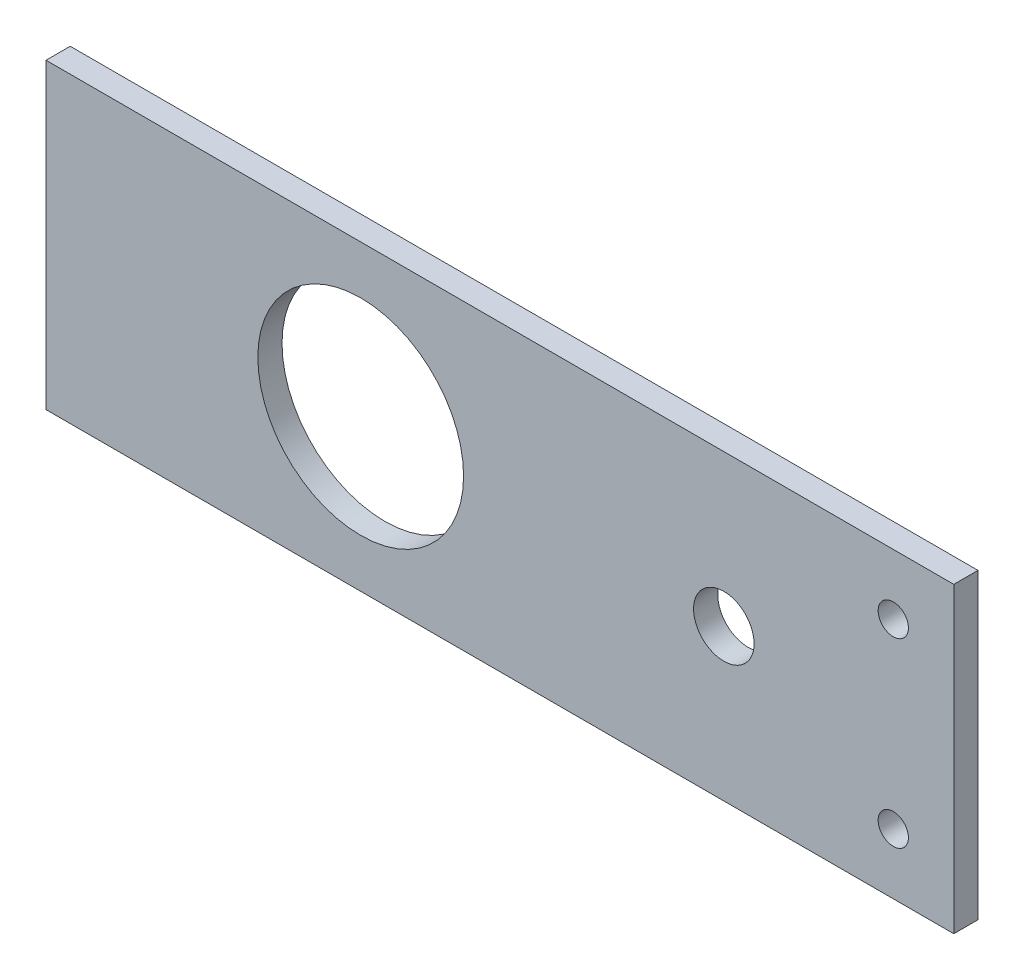
ISO-10303-21;
HEADER;
FILE_DESCRIPTION(('STEP AP214'),'2;1');
FILE_NAME('part.step','',(''),(''),'','','');
FILE_SCHEMA(('AUTOMOTIVE_DESIGN { 1 0 10303 214 1 1 1 1 }'));
ENDSEC;
DATA;
#1=APPLICATION_CONTEXT('core data for automotive mechanical design processes');
#2=APPLICATION_PROTOCOL_DEFINITION('international standard','automotive_design',2000,#1);
#3=PRODUCT_CONTEXT('',#1,'mechanical');
#4=PRODUCT('Part','Part','',(#3));
#5=PRODUCT_RELATED_PRODUCT_CATEGORY('part','',(#4));
#6=PRODUCT_DEFINITION_FORMATION('','',#4);
#7=PRODUCT_DEFINITION_CONTEXT('part definition',#1,'design');
#8=PRODUCT_DEFINITION('design','',#6,#7);
#9=PRODUCT_DEFINITION_SHAPE('','',#8);
#10=(LENGTH_UNIT() NAMED_UNIT(*) SI_UNIT(.MILLI.,.METRE.));
#11=(NAMED_UNIT(*) PLANE_ANGLE_UNIT() SI_UNIT($,.RADIAN.));
#12=(NAMED_UNIT(*) SI_UNIT($,.STERADIAN.) SOLID_ANGLE_UNIT());
#13=UNCERTAINTY_MEASURE_WITH_UNIT(LENGTH_MEASURE(1.E-05),#10,'distance_accuracy_value','');
#14=(GEOMETRIC_REPRESENTATION_CONTEXT(3) GLOBAL_UNCERTAINTY_ASSIGNED_CONTEXT((#13)) GLOBAL_UNIT_ASSIGNED_CONTEXT((#10,
#11,#12)) REPRESENTATION_CONTEXT('',''));
#15=CARTESIAN_POINT('',(0.,0.,0.));
#16=DIRECTION('',(0.,0.,1.));
#17=DIRECTION('',(1.,0.,0.));
#18=AXIS2_PLACEMENT_3D('',#15,#16,#17);
#19=CARTESIAN_POINT('',(0.,0.,4.));
#20=DIRECTION('',(0.,0.,1.));
#21=DIRECTION('',(1.,0.,0.));
#22=AXIS2_PLACEMENT_3D('',#19,#20,#21);
#23=PLANE('',#22);
#24=CARTESIAN_POINT('',(65.,15.,4.));
#25=DIRECTION('',(0.,0.,1.));
#26=DIRECTION('',(1.,0.,0.));
#27=AXIS2_PLACEMENT_3D('',#24,#25,#26);
#28=CIRCLE('',#27,2.5);
#29=CARTESIAN_POINT('',(67.5,15.,4.));
#30=VERTEX_POINT('',#29);
#31=EDGE_CURVE('E127',#30,#30,#28,.T.);
#32=ORIENTED_EDGE('',*,*,#31,.F.);
#33=EDGE_LOOP('',(#32));
#34=FACE_BOUND('',#33,.T.);
#35=CARTESIAN_POINT('',(65.,-15.,4.));
#36=DIRECTION('',(0.,0.,1.));
#37=DIRECTION('',(1.,0.,0.));
#38=AXIS2_PLACEMENT_3D('',#35,#36,#37);
#39=CIRCLE('',#38,2.5);
#40=CARTESIAN_POINT('',(67.5,-15.,4.));
#41=VERTEX_POINT('',#40);
#42=EDGE_CURVE('E135',#41,#41,#39,.T.);
#43=ORIENTED_EDGE('',*,*,#42,.F.);
#44=EDGE_LOOP('',(#43));
#45=FACE_BOUND('',#44,.T.);
#46=CARTESIAN_POINT('',(37.,0.,4.));
#47=DIRECTION('',(0.,0.,1.));
#48=DIRECTION('',(1.,0.,0.));
#49=AXIS2_PLACEMENT_3D('',#46,#47,#48);
#50=CIRCLE('',#49,4.99999999999998);
#51=CARTESIAN_POINT('',(42.,0.,4.));
#52=VERTEX_POINT('',#51);
#53=EDGE_CURVE('E114',#52,#52,#50,.T.);
#54=ORIENTED_EDGE('',*,*,#53,.F.);
#55=EDGE_LOOP('',(#54));
#56=FACE_BOUND('',#55,.T.);
#57=DIRECTION('',(0.,-1.,0.));
#58=VECTOR('',#57,1.);
#59=CARTESIAN_POINT('',(-75.,-25.,4.));
#60=LINE('',#59,#58);
#61=CARTESIAN_POINT('',(-75.,25.,4.));
#62=VERTEX_POINT('',#61);
#63=CARTESIAN_POINT('',(-75.,-25.,4.));
#64=VERTEX_POINT('',#63);
#65=EDGE_CURVE('E93',#62,#64,#60,.T.);
#66=ORIENTED_EDGE('',*,*,#65,.T.);
#67=DIRECTION('',(1.,0.,0.));
#68=VECTOR('',#67,1.);
#69=CARTESIAN_POINT('',(75.,-25.,4.));
#70=LINE('',#69,#68);
#71=CARTESIAN_POINT('',(75.,-25.,4.));
#72=VERTEX_POINT('',#71);
#73=EDGE_CURVE('E88',#64,#72,#70,.T.);
#74=ORIENTED_EDGE('',*,*,#73,.T.);
#75=DIRECTION('',(0.,1.,0.));
#76=VECTOR('',#75,1.);
#77=CARTESIAN_POINT('',(75.,-25.,4.));
#78=LINE('',#77,#76);
#79=CARTESIAN_POINT('',(75.,25.,4.));
#80=VERTEX_POINT('',#79);
#81=EDGE_CURVE('E91',#72,#80,#78,.T.);
#82=ORIENTED_EDGE('',*,*,#81,.T.);
#83=DIRECTION('',(-1.,0.,0.));
#84=VECTOR('',#83,1.);
#85=CARTESIAN_POINT('',(75.,25.,4.));
#86=LINE('',#85,#84);
#87=EDGE_CURVE('E58',#80,#62,#86,.T.);
#88=ORIENTED_EDGE('',*,*,#87,.T.);
#89=EDGE_LOOP('',(#66,#74,#82,#88));
#90=FACE_BOUND('',#89,.T.);
#91=CARTESIAN_POINT('',(-23.,0.,4.));
#92=DIRECTION('',(0.,0.,1.));
#93=DIRECTION('',(1.,0.,0.));
#94=AXIS2_PLACEMENT_3D('',#91,#92,#93);
#95=CIRCLE('',#94,17.);
#96=CARTESIAN_POINT('',(-6.,0.,4.));
#97=VERTEX_POINT('',#96);
#98=EDGE_CURVE('E143',#97,#97,#95,.T.);
#99=ORIENTED_EDGE('',*,*,#98,.F.);
#100=EDGE_LOOP('',(#99));
#101=FACE_BOUND('',#100,.T.);
#102=ADVANCED_FACE('F38',(#34,#45,#56,#90,#101),#23,.T.);
#103=CARTESIAN_POINT('',(0.,0.,0.));
#104=DIRECTION('',(0.,0.,1.));
#105=DIRECTION('',(1.,0.,0.));
#106=AXIS2_PLACEMENT_3D('',#103,#104,#105);
#107=PLANE('',#106);
#108=CARTESIAN_POINT('',(65.,15.,0.));
#109=DIRECTION('',(0.,0.,1.));
#110=DIRECTION('',(1.,0.,0.));
#111=AXIS2_PLACEMENT_3D('',#108,#109,#110);
#112=CIRCLE('',#111,2.5);
#113=CARTESIAN_POINT('',(67.5,15.,0.));
#114=VERTEX_POINT('',#113);
#115=EDGE_CURVE('E42',#114,#114,#112,.T.);
#116=ORIENTED_EDGE('',*,*,#115,.T.);
#117=EDGE_LOOP('',(#116));
#118=FACE_BOUND('',#117,.T.);
#119=CARTESIAN_POINT('',(65.,-15.,0.));
#120=DIRECTION('',(0.,0.,1.));
#121=DIRECTION('',(1.,0.,0.));
#122=AXIS2_PLACEMENT_3D('',#119,#120,#121);
#123=CIRCLE('',#122,2.5);
#124=CARTESIAN_POINT('',(67.5,-15.,0.));
#125=VERTEX_POINT('',#124);
#126=EDGE_CURVE('E124',#125,#125,#123,.T.);
#127=ORIENTED_EDGE('',*,*,#126,.T.);
#128=EDGE_LOOP('',(#127));
#129=FACE_BOUND('',#128,.T.);
#130=DIRECTION('',(0.,-1.,0.));
#131=VECTOR('',#130,1.);
#132=CARTESIAN_POINT('',(-75.,-25.,0.));
#133=LINE('',#132,#131);
#134=CARTESIAN_POINT('',(-75.,25.,0.));
#135=VERTEX_POINT('',#134);
#136=CARTESIAN_POINT('',(-75.,-25.,0.));
#137=VERTEX_POINT('',#136);
#138=EDGE_CURVE('E110',#135,#137,#133,.T.);
#139=ORIENTED_EDGE('',*,*,#138,.F.);
#140=DIRECTION('',(-1.,0.,0.));
#141=VECTOR('',#140,1.);
#142=CARTESIAN_POINT('',(75.,25.,0.));
#143=LINE('',#142,#141);
#144=CARTESIAN_POINT('',(75.,25.,0.));
#145=VERTEX_POINT('',#144);
#146=EDGE_CURVE('E81',#145,#135,#143,.T.);
#147=ORIENTED_EDGE('',*,*,#146,.F.);
#148=DIRECTION('',(0.,1.,0.));
#149=VECTOR('',#148,1.);
#150=CARTESIAN_POINT('',(75.,-25.,0.));
#151=LINE('',#150,#149);
#152=CARTESIAN_POINT('',(75.,-25.,0.));
#153=VERTEX_POINT('',#152);
#154=EDGE_CURVE('E75',#153,#145,#151,.T.);
#155=ORIENTED_EDGE('',*,*,#154,.F.);
#156=DIRECTION('',(1.,0.,0.));
#157=VECTOR('',#156,1.);
#158=CARTESIAN_POINT('',(75.,-25.,0.));
#159=LINE('',#158,#157);
#160=EDGE_CURVE('E98',#137,#153,#159,.T.);
#161=ORIENTED_EDGE('',*,*,#160,.F.);
#162=EDGE_LOOP('',(#139,#147,#155,#161));
#163=FACE_BOUND('',#162,.T.);
#164=CARTESIAN_POINT('',(37.,0.,0.));
#165=DIRECTION('',(0.,0.,1.));
#166=DIRECTION('',(1.,0.,0.));
#167=AXIS2_PLACEMENT_3D('',#164,#165,#166);
#168=CIRCLE('',#167,4.99999999999998);
#169=CARTESIAN_POINT('',(42.,0.,0.));
#170=VERTEX_POINT('',#169);
#171=EDGE_CURVE('E147',#170,#170,#168,.T.);
#172=ORIENTED_EDGE('',*,*,#171,.T.);
#173=EDGE_LOOP('',(#172));
#174=FACE_BOUND('',#173,.T.);
#175=CARTESIAN_POINT('',(-23.,0.,0.));
#176=DIRECTION('',(0.,0.,1.));
#177=DIRECTION('',(1.,0.,0.));
#178=AXIS2_PLACEMENT_3D('',#175,#176,#177);
#179=CIRCLE('',#178,17.);
#180=CARTESIAN_POINT('',(-6.,0.,0.));
#181=VERTEX_POINT('',#180);
#182=EDGE_CURVE('E133',#181,#181,#179,.T.);
#183=ORIENTED_EDGE('',*,*,#182,.T.);
#184=EDGE_LOOP('',(#183));
#185=FACE_BOUND('',#184,.T.);
#186=ADVANCED_FACE('F159',(#118,#129,#163,#174,#185),#107,.F.);
#187=CARTESIAN_POINT('',(-75.,-25.,4.));
#188=DIRECTION('',(1.,0.,0.));
#189=DIRECTION('',(0.,0.,-1.));
#190=AXIS2_PLACEMENT_3D('',#187,#188,#189);
#191=PLANE('',#190);
#192=ORIENTED_EDGE('',*,*,#138,.T.);
#193=DIRECTION('',(0.,0.,-1.));
#194=VECTOR('',#193,1.);
#195=CARTESIAN_POINT('',(-75.,-25.,4.));
#196=LINE('',#195,#194);
#197=EDGE_CURVE('E11',#64,#137,#196,.T.);
#198=ORIENTED_EDGE('',*,*,#197,.F.);
#199=ORIENTED_EDGE('',*,*,#65,.F.);
#200=DIRECTION('',(0.,0.,-1.));
#201=VECTOR('',#200,1.);
#202=CARTESIAN_POINT('',(-75.,25.,4.));
#203=LINE('',#202,#201);
#204=EDGE_CURVE('E106',#62,#135,#203,.T.);
#205=ORIENTED_EDGE('',*,*,#204,.T.);
#206=EDGE_LOOP('',(#192,#198,#199,#205));
#207=FACE_BOUND('',#206,.T.);
#208=ADVANCED_FACE('F40',(#207),#191,.F.);
#209=CARTESIAN_POINT('',(75.,-25.,4.));
#210=DIRECTION('',(0.,1.,0.));
#211=DIRECTION('',(-1.,0.,0.));
#212=AXIS2_PLACEMENT_3D('',#209,#210,#211);
#213=PLANE('',#212);
#214=ORIENTED_EDGE('',*,*,#160,.T.);
#215=DIRECTION('',(0.,0.,-1.));
#216=VECTOR('',#215,1.);
#217=CARTESIAN_POINT('',(75.,-25.,4.));
#218=LINE('',#217,#216);
#219=EDGE_CURVE('E49',#72,#153,#218,.T.);
#220=ORIENTED_EDGE('',*,*,#219,.F.);
#221=ORIENTED_EDGE('',*,*,#73,.F.);
#222=ORIENTED_EDGE('',*,*,#197,.T.);
#223=EDGE_LOOP('',(#214,#220,#221,#222));
#224=FACE_BOUND('',#223,.T.);
#225=ADVANCED_FACE('F97',(#224),#213,.F.);
#226=CARTESIAN_POINT('',(75.,-25.,4.));
#227=DIRECTION('',(-1.,0.,0.));
#228=DIRECTION('',(0.,0.,1.));
#229=AXIS2_PLACEMENT_3D('',#226,#227,#228);
#230=PLANE('',#229);
#231=ORIENTED_EDGE('',*,*,#154,.T.);
#232=DIRECTION('',(0.,0.,-1.));
#233=VECTOR('',#232,1.);
#234=CARTESIAN_POINT('',(75.,25.,4.));
#235=LINE('',#234,#233);
#236=EDGE_CURVE('E100',#80,#145,#235,.T.);
#237=ORIENTED_EDGE('',*,*,#236,.F.);
#238=ORIENTED_EDGE('',*,*,#81,.F.);
#239=ORIENTED_EDGE('',*,*,#219,.T.);
#240=EDGE_LOOP('',(#231,#237,#238,#239));
#241=FACE_BOUND('',#240,.T.);
#242=ADVANCED_FACE('F102',(#241),#230,.F.);
#243=CARTESIAN_POINT('',(75.,25.,4.));
#244=DIRECTION('',(0.,-1.,0.));
#245=DIRECTION('',(1.,0.,0.));
#246=AXIS2_PLACEMENT_3D('',#243,#244,#245);
#247=PLANE('',#246);
#248=ORIENTED_EDGE('',*,*,#146,.T.);
#249=ORIENTED_EDGE('',*,*,#204,.F.);
#250=ORIENTED_EDGE('',*,*,#87,.F.);
#251=ORIENTED_EDGE('',*,*,#236,.T.);
#252=EDGE_LOOP('',(#248,#249,#250,#251));
#253=FACE_BOUND('',#252,.T.);
#254=ADVANCED_FACE('F165',(#253),#247,.F.);
#255=CARTESIAN_POINT('',(37.,0.,4.));
#256=DIRECTION('',(0.,0.,-1.));
#257=DIRECTION('',(-1.,0.,0.));
#258=AXIS2_PLACEMENT_3D('',#255,#256,#257);
#259=CYLINDRICAL_SURFACE('',#258,4.99999999999998);
#260=ORIENTED_EDGE('',*,*,#53,.T.);
#261=EDGE_LOOP('',(#260));
#262=FACE_BOUND('',#261,.T.);
#263=ORIENTED_EDGE('',*,*,#171,.F.);
#264=EDGE_LOOP('',(#263));
#265=FACE_BOUND('',#264,.T.);
#266=ADVANCED_FACE('F162',(#262,#265),#259,.F.);
#267=CARTESIAN_POINT('',(-23.,0.,4.));
#268=DIRECTION('',(0.,0.,-1.));
#269=DIRECTION('',(-1.,0.,0.));
#270=AXIS2_PLACEMENT_3D('',#267,#268,#269);
#271=CYLINDRICAL_SURFACE('',#270,17.);
#272=ORIENTED_EDGE('',*,*,#98,.T.);
#273=EDGE_LOOP('',(#272));
#274=FACE_BOUND('',#273,.T.);
#275=ORIENTED_EDGE('',*,*,#182,.F.);
#276=EDGE_LOOP('',(#275));
#277=FACE_BOUND('',#276,.T.);
#278=ADVANCED_FACE('F164',(#274,#277),#271,.F.);
#279=CARTESIAN_POINT('',(65.,-15.,-6.));
#280=DIRECTION('',(0.,0.,1.));
#281=DIRECTION('',(1.,0.,0.));
#282=AXIS2_PLACEMENT_3D('',#279,#280,#281);
#283=CYLINDRICAL_SURFACE('',#282,2.5);
#284=ORIENTED_EDGE('',*,*,#42,.T.);
#285=EDGE_LOOP('',(#284));
#286=FACE_BOUND('',#285,.T.);
#287=ORIENTED_EDGE('',*,*,#126,.F.);
#288=EDGE_LOOP('',(#287));
#289=FACE_BOUND('',#288,.T.);
#290=ADVANCED_FACE('F172',(#286,#289),#283,.F.);
#291=CARTESIAN_POINT('',(65.,15.,-6.));
#292=DIRECTION('',(0.,0.,1.));
#293=DIRECTION('',(1.,0.,0.));
#294=AXIS2_PLACEMENT_3D('',#291,#292,#293);
#295=CYLINDRICAL_SURFACE('',#294,2.5);
#296=ORIENTED_EDGE('',*,*,#31,.T.);
#297=EDGE_LOOP('',(#296));
#298=FACE_BOUND('',#297,.T.);
#299=ORIENTED_EDGE('',*,*,#115,.F.);
#300=EDGE_LOOP('',(#299));
#301=FACE_BOUND('',#300,.T.);
#302=ADVANCED_FACE('F214',(#298,#301),#295,.F.);
#303=CLOSED_SHELL('',(#102,#186,#208,#225,#242,#254,#266,#278,#290,#302));
#304=MANIFOLD_SOLID_BREP('B2',#303);
#305=ADVANCED_BREP_SHAPE_REPRESENTATION('',(#18,#304),#14);
#306=SHAPE_DEFINITION_REPRESENTATION(#9,#305);
ENDSEC;
END-ISO-10303-21;
